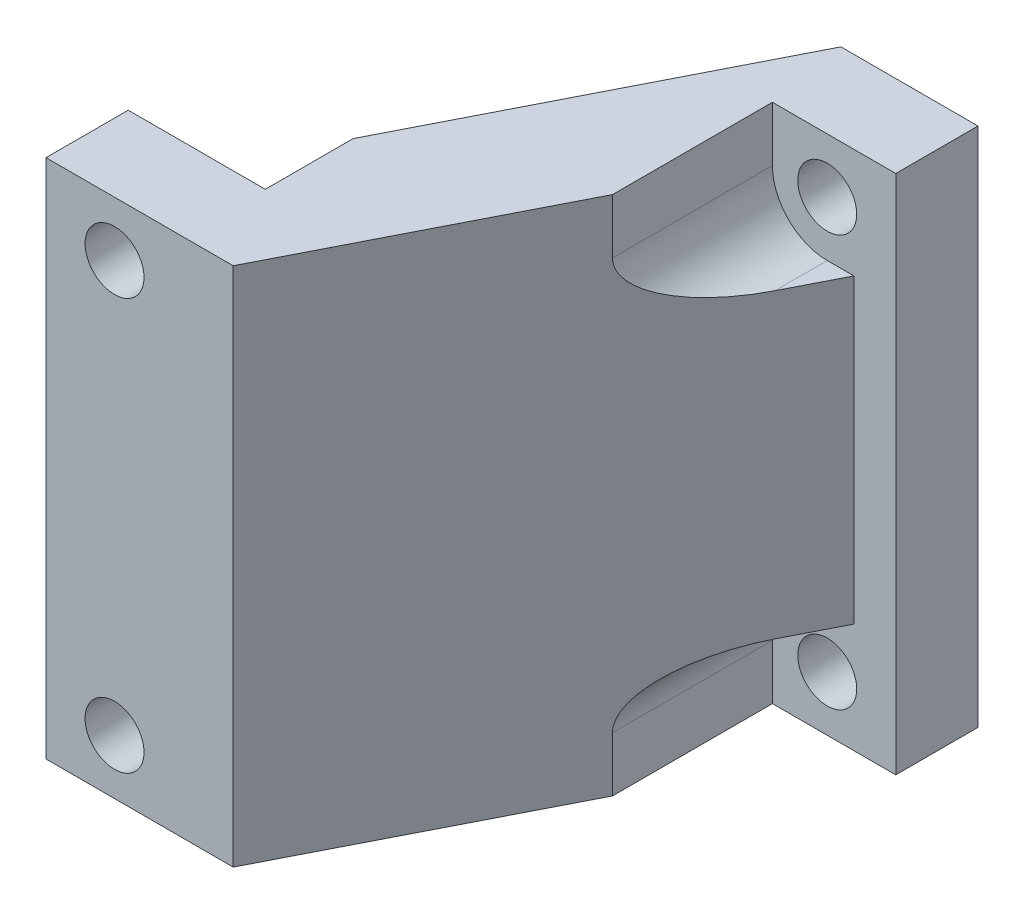
ISO-10303-21;
HEADER;
FILE_DESCRIPTION(('STEP AP214'),'2;1');
FILE_NAME('part.step','',(''),(''),'','','');
FILE_SCHEMA(('AUTOMOTIVE_DESIGN { 1 0 10303 214 1 1 1 1 }'));
ENDSEC;
DATA;
#1=APPLICATION_CONTEXT('core data for automotive mechanical design processes');
#2=APPLICATION_PROTOCOL_DEFINITION('international standard','automotive_design',2000,#1);
#3=PRODUCT_CONTEXT('',#1,'mechanical');
#4=PRODUCT('Part','Part','',(#3));
#5=PRODUCT_RELATED_PRODUCT_CATEGORY('part','',(#4));
#6=PRODUCT_DEFINITION_FORMATION('','',#4);
#7=PRODUCT_DEFINITION_CONTEXT('part definition',#1,'design');
#8=PRODUCT_DEFINITION('design','',#6,#7);
#9=PRODUCT_DEFINITION_SHAPE('','',#8);
#10=(LENGTH_UNIT() NAMED_UNIT(*) SI_UNIT(.MILLI.,.METRE.));
#11=(NAMED_UNIT(*) PLANE_ANGLE_UNIT() SI_UNIT($,.RADIAN.));
#12=(NAMED_UNIT(*) SI_UNIT($,.STERADIAN.) SOLID_ANGLE_UNIT());
#13=UNCERTAINTY_MEASURE_WITH_UNIT(LENGTH_MEASURE(1.E-05),#10,'distance_accuracy_value','');
#14=(GEOMETRIC_REPRESENTATION_CONTEXT(3) GLOBAL_UNCERTAINTY_ASSIGNED_CONTEXT((#13)) GLOBAL_UNIT_ASSIGNED_CONTEXT((#10,
#11,#12)) REPRESENTATION_CONTEXT('',''));
#15=CARTESIAN_POINT('',(0.,0.,0.));
#16=DIRECTION('',(0.,0.,1.));
#17=DIRECTION('',(1.,0.,0.));
#18=AXIS2_PLACEMENT_3D('',#15,#16,#17);
#19=CARTESIAN_POINT('',(134.360280761,-68.005114056,-48.2));
#20=DIRECTION('',(-0.891354901098317,0.,-0.45330612205));
#21=DIRECTION('',(-0.45330612205,0.,0.891354901098317));
#22=AXIS2_PLACEMENT_3D('',#19,#20,#21);
#23=PLANE('',#22);
#24=DIRECTION('',(-0.45330612205,0.,0.891354901098317));
#25=VECTOR('',#24,1.);
#26=CARTESIAN_POINT('',(141.988658439,-68.005114056,-63.2));
#27=LINE('',#26,#25);
#28=CARTESIAN_POINT('',(141.988658439,-68.005114056,-63.2));
#29=VERTEX_POINT('',#28);
#30=CARTESIAN_POINT('',(129.988658439,-68.005114056,-39.603895088));
#31=VERTEX_POINT('',#30);
#32=EDGE_CURVE('E11',#29,#31,#27,.T.);
#33=ORIENTED_EDGE('',*,*,#32,.T.);
#34=DIRECTION('',(0.,1.,0.));
#35=VECTOR('',#34,1.);
#36=CARTESIAN_POINT('',(129.988658439,-68.005114056,-39.603895088));
#37=LINE('',#36,#35);
#38=CARTESIAN_POINT('',(129.988658439,-64.005114056,-39.603895088));
#39=VERTEX_POINT('',#38);
#40=EDGE_CURVE('E48',#31,#39,#37,.T.);
#41=ORIENTED_EDGE('',*,*,#40,.T.);
#42=CARTESIAN_POINT('',(124.988658439,-64.005114056,-29.772184708));
#43=DIRECTION('',(0.891354901098317,0.,0.45330612205));
#44=DIRECTION('',(0.45330612205,0.,-0.891354901098317));
#45=AXIS2_PLACEMENT_3D('',#42,#43,#44);
#46=ELLIPSE('',#45,11.030073844,5.);
#47=CARTESIAN_POINT('',(126.731903083,-59.318847086,-33.2));
#48=VERTEX_POINT('',#47);
#49=EDGE_CURVE('E225',#39,#48,#46,.T.);
#50=ORIENTED_EDGE('',*,*,#49,.T.);
#51=DIRECTION('',(0.,1.,0.));
#52=VECTOR('',#51,1.);
#53=CARTESIAN_POINT('',(126.731903083,-59.318847086,-33.2));
#54=LINE('',#53,#52);
#55=CARTESIAN_POINT('',(126.731903083,-38.691381026,-33.2));
#56=VERTEX_POINT('',#55);
#57=EDGE_CURVE('E228',#48,#56,#54,.T.);
#58=ORIENTED_EDGE('',*,*,#57,.T.);
#59=CARTESIAN_POINT('',(124.988658439,-34.005114056,-29.772184708));
#60=DIRECTION('',(0.891354901098317,0.,0.45330612205));
#61=DIRECTION('',(0.45330612205,0.,-0.891354901098317));
#62=AXIS2_PLACEMENT_3D('',#59,#60,#61);
#63=ELLIPSE('',#62,11.030073844,5.);
#64=CARTESIAN_POINT('',(129.988658439,-34.005114056,-39.603895088));
#65=VERTEX_POINT('',#64);
#66=EDGE_CURVE('E248',#56,#65,#63,.T.);
#67=ORIENTED_EDGE('',*,*,#66,.T.);
#68=DIRECTION('',(0.,1.,0.));
#69=VECTOR('',#68,1.);
#70=CARTESIAN_POINT('',(129.988658439,-34.005114056,-39.603895088));
#71=LINE('',#70,#69);
#72=CARTESIAN_POINT('',(129.988658439,-30.005114056,-39.603895088));
#73=VERTEX_POINT('',#72);
#74=EDGE_CURVE('E222',#65,#73,#71,.T.);
#75=ORIENTED_EDGE('',*,*,#74,.T.);
#76=DIRECTION('',(-0.45330612205,0.,0.891354901098317));
#77=VECTOR('',#76,1.);
#78=CARTESIAN_POINT('',(141.988658439,-30.005114056,-63.2));
#79=LINE('',#78,#77);
#80=CARTESIAN_POINT('',(141.988658439,-30.005114056,-63.2));
#81=VERTEX_POINT('',#80);
#82=EDGE_CURVE('E182',#81,#73,#79,.T.);
#83=ORIENTED_EDGE('',*,*,#82,.F.);
#84=DIRECTION('',(0.,1.,0.));
#85=VECTOR('',#84,1.);
#86=CARTESIAN_POINT('',(141.988658439,-68.005114056,-63.2));
#87=LINE('',#86,#85);
#88=EDGE_CURVE('E42',#29,#81,#87,.T.);
#89=ORIENTED_EDGE('',*,*,#88,.F.);
#90=EDGE_LOOP('',(#33,#41,#50,#58,#67,#75,#83,#89));
#91=FACE_BOUND('',#90,.T.);
#92=ADVANCED_FACE('F38',(#91),#23,.T.);
#93=CARTESIAN_POINT('',(-140.011341561,-68.005114056,247.8));
#94=DIRECTION('',(0.,-1.,0.));
#95=DIRECTION('',(0.,0.,-1.));
#96=AXIS2_PLACEMENT_3D('',#93,#94,#95);
#97=PLANE('',#96);
#98=DIRECTION('',(1.,0.,0.));
#99=VECTOR('',#98,1.);
#100=CARTESIAN_POINT('',(119.988658439,-68.005114056,-33.2));
#101=LINE('',#100,#99);
#102=CARTESIAN_POINT('',(119.988658439,-68.005114056,-33.2));
#103=VERTEX_POINT('',#102);
#104=CARTESIAN_POINT('',(129.988658439,-68.005114056,-33.2));
#105=VERTEX_POINT('',#104);
#106=EDGE_CURVE('E190',#103,#105,#101,.T.);
#107=ORIENTED_EDGE('',*,*,#106,.T.);
#108=DIRECTION('',(0.,0.,-1.));
#109=VECTOR('',#108,1.);
#110=CARTESIAN_POINT('',(129.988658439,-68.005114056,-33.2));
#111=LINE('',#110,#109);
#112=EDGE_CURVE('E187',#105,#31,#111,.T.);
#113=ORIENTED_EDGE('',*,*,#112,.T.);
#114=ORIENTED_EDGE('',*,*,#32,.F.);
#115=DIRECTION('',(-1.,0.,0.));
#116=VECTOR('',#115,1.);
#117=CARTESIAN_POINT('',(151.988658439,-68.005114056,-63.2));
#118=LINE('',#117,#116);
#119=CARTESIAN_POINT('',(151.988658439,-68.005114056,-63.2));
#120=VERTEX_POINT('',#119);
#121=EDGE_CURVE('E329',#120,#29,#118,.T.);
#122=ORIENTED_EDGE('',*,*,#121,.F.);
#123=DIRECTION('',(0.,0.,1.));
#124=VECTOR('',#123,1.);
#125=CARTESIAN_POINT('',(151.988658439,-68.005114056,-63.2));
#126=LINE('',#125,#124);
#127=CARTESIAN_POINT('',(151.988658439,-68.005114056,-57.2));
#128=VERTEX_POINT('',#127);
#129=EDGE_CURVE('E191',#120,#128,#126,.T.);
#130=ORIENTED_EDGE('',*,*,#129,.T.);
#131=DIRECTION('',(-1.,0.,0.));
#132=VECTOR('',#131,1.);
#133=CARTESIAN_POINT('',(151.988658439,-68.005114056,-57.2));
#134=LINE('',#133,#132);
#135=CARTESIAN_POINT('',(142.988658439,-68.005114056,-57.2));
#136=VERTEX_POINT('',#135);
#137=EDGE_CURVE('E241',#128,#136,#134,.T.);
#138=ORIENTED_EDGE('',*,*,#137,.T.);
#139=DIRECTION('',(0.,0.,-1.));
#140=VECTOR('',#139,1.);
#141=CARTESIAN_POINT('',(142.988658439,-68.005114056,-45.533696838));
#142=LINE('',#141,#140);
#143=CARTESIAN_POINT('',(142.988658439,-68.005114056,-45.533696838));
#144=VERTEX_POINT('',#143);
#145=EDGE_CURVE('E235',#144,#136,#142,.T.);
#146=ORIENTED_EDGE('',*,*,#145,.F.);
#147=DIRECTION('',(0.453933197028941,0.,-0.891035719056809));
#148=VECTOR('',#147,1.);
#149=CARTESIAN_POINT('',(133.648658439,-68.005114056,-27.2));
#150=LINE('',#149,#148);
#151=CARTESIAN_POINT('',(133.648658439,-68.005114056,-27.2));
#152=VERTEX_POINT('',#151);
#153=EDGE_CURVE('E219',#152,#144,#150,.T.);
#154=ORIENTED_EDGE('',*,*,#153,.F.);
#155=DIRECTION('',(1.,0.,0.));
#156=VECTOR('',#155,1.);
#157=CARTESIAN_POINT('',(119.988658439,-68.005114056,-27.2));
#158=LINE('',#157,#156);
#159=CARTESIAN_POINT('',(119.988658439,-68.005114056,-27.2));
#160=VERTEX_POINT('',#159);
#161=EDGE_CURVE('E255',#160,#152,#158,.T.);
#162=ORIENTED_EDGE('',*,*,#161,.F.);
#163=DIRECTION('',(0.,0.,-1.));
#164=VECTOR('',#163,1.);
#165=CARTESIAN_POINT('',(119.988658439,-68.005114056,-27.2));
#166=LINE('',#165,#164);
#167=EDGE_CURVE('E244',#160,#103,#166,.T.);
#168=ORIENTED_EDGE('',*,*,#167,.T.);
#169=EDGE_LOOP('',(#107,#113,#114,#122,#130,#138,#146,#154,#162,#168));
#170=FACE_BOUND('',#169,.T.);
#171=ADVANCED_FACE('F399',(#170),#97,.T.);
#172=CARTESIAN_POINT('',(142.818658439,-68.005114056,-45.2));
#173=DIRECTION('',(0.891035719056809,0.,0.453933197028941));
#174=DIRECTION('',(0.,-1.,0.));
#175=AXIS2_PLACEMENT_3D('',#172,#173,#174);
#176=PLANE('',#175);
#177=CARTESIAN_POINT('',(146.988658439,-64.005114056,-53.385387132));
#178=DIRECTION('',(-0.891035719056809,0.,-0.453933197028941));
#179=DIRECTION('',(0.453933197028941,0.,-0.891035719056809));
#180=AXIS2_PLACEMENT_3D('',#177,#178,#179);
#181=ELLIPSE('',#180,8.811869295,4.);
#182=CARTESIAN_POINT('',(142.988658439,-64.005114056,-45.533696838));
#183=VERTEX_POINT('',#182);
#184=CARTESIAN_POINT('',(146.988658439,-60.005114056,-53.385387132));
#185=VERTEX_POINT('',#184);
#186=EDGE_CURVE('E272',#183,#185,#181,.T.);
#187=ORIENTED_EDGE('',*,*,#186,.T.);
#188=DIRECTION('',(0.453933197028941,0.,-0.891035719056809));
#189=VECTOR('',#188,1.);
#190=CARTESIAN_POINT('',(146.988658439,-60.005114056,-53.385387132));
#191=LINE('',#190,#189);
#192=CARTESIAN_POINT('',(148.931991772,-60.005114056,-57.2));
#193=VERTEX_POINT('',#192);
#194=EDGE_CURVE('E109',#185,#193,#191,.T.);
#195=ORIENTED_EDGE('',*,*,#194,.T.);
#196=DIRECTION('',(0.,1.,0.));
#197=VECTOR('',#196,1.);
#198=CARTESIAN_POINT('',(148.931991772,-60.005114056,-57.2));
#199=LINE('',#198,#197);
#200=CARTESIAN_POINT('',(148.931991772,-38.005114056,-57.2));
#201=VERTEX_POINT('',#200);
#202=EDGE_CURVE('E101',#193,#201,#199,.T.);
#203=ORIENTED_EDGE('',*,*,#202,.T.);
#204=DIRECTION('',(-0.453933197028941,0.,0.891035719056809));
#205=VECTOR('',#204,1.);
#206=CARTESIAN_POINT('',(148.931991772,-38.005114056,-57.2));
#207=LINE('',#206,#205);
#208=CARTESIAN_POINT('',(146.988658439,-38.005114056,-53.385387132));
#209=VERTEX_POINT('',#208);
#210=EDGE_CURVE('E310',#201,#209,#207,.T.);
#211=ORIENTED_EDGE('',*,*,#210,.T.);
#212=CARTESIAN_POINT('',(146.988658439,-34.005114056,-53.385387132));
#213=DIRECTION('',(-0.891035719056809,0.,-0.453933197028941));
#214=DIRECTION('',(0.453933197028941,0.,-0.891035719056809));
#215=AXIS2_PLACEMENT_3D('',#212,#213,#214);
#216=ELLIPSE('',#215,8.811869295,4.);
#217=CARTESIAN_POINT('',(142.988658439,-34.005114056,-45.533696838));
#218=VERTEX_POINT('',#217);
#219=EDGE_CURVE('E218',#209,#218,#216,.T.);
#220=ORIENTED_EDGE('',*,*,#219,.T.);
#221=DIRECTION('',(0.,1.,0.));
#222=VECTOR('',#221,1.);
#223=CARTESIAN_POINT('',(142.988658439,-34.005114056,-45.533696838));
#224=LINE('',#223,#222);
#225=CARTESIAN_POINT('',(142.988658439,-30.005114056,-45.533696838));
#226=VERTEX_POINT('',#225);
#227=EDGE_CURVE('E215',#218,#226,#224,.T.);
#228=ORIENTED_EDGE('',*,*,#227,.T.);
#229=DIRECTION('',(0.453933197028941,0.,-0.891035719056809));
#230=VECTOR('',#229,1.);
#231=CARTESIAN_POINT('',(133.648658439,-30.005114056,-27.2));
#232=LINE('',#231,#230);
#233=CARTESIAN_POINT('',(133.648658439,-30.005114056,-27.2));
#234=VERTEX_POINT('',#233);
#235=EDGE_CURVE('E183',#234,#226,#232,.T.);
#236=ORIENTED_EDGE('',*,*,#235,.F.);
#237=DIRECTION('',(0.,1.,0.));
#238=VECTOR('',#237,1.);
#239=CARTESIAN_POINT('',(133.648658439,-68.005114056,-27.2));
#240=LINE('',#239,#238);
#241=EDGE_CURVE('E239',#152,#234,#240,.T.);
#242=ORIENTED_EDGE('',*,*,#241,.F.);
#243=ORIENTED_EDGE('',*,*,#153,.T.);
#244=DIRECTION('',(0.,1.,0.));
#245=VECTOR('',#244,1.);
#246=CARTESIAN_POINT('',(142.988658439,-68.005114056,-45.533696838));
#247=LINE('',#246,#245);
#248=EDGE_CURVE('E196',#144,#183,#247,.T.);
#249=ORIENTED_EDGE('',*,*,#248,.T.);
#250=EDGE_LOOP('',(#187,#195,#203,#211,#220,#228,#236,#242,#243,#249));
#251=FACE_BOUND('',#250,.T.);
#252=ADVANCED_FACE('F383',(#251),#176,.T.);
#253=CARTESIAN_POINT('',(-140.011341561,-30.005114056,247.8));
#254=DIRECTION('',(0.,-1.,0.));
#255=DIRECTION('',(0.,0.,-1.));
#256=AXIS2_PLACEMENT_3D('',#253,#254,#255);
#257=PLANE('',#256);
#258=DIRECTION('',(0.,0.,-1.));
#259=VECTOR('',#258,1.);
#260=CARTESIAN_POINT('',(129.988658439,-30.005114056,-33.2));
#261=LINE('',#260,#259);
#262=CARTESIAN_POINT('',(129.988658439,-30.005114056,-33.2));
#263=VERTEX_POINT('',#262);
#264=EDGE_CURVE('E261',#263,#73,#261,.T.);
#265=ORIENTED_EDGE('',*,*,#264,.F.);
#266=DIRECTION('',(1.,0.,0.));
#267=VECTOR('',#266,1.);
#268=CARTESIAN_POINT('',(119.988658439,-30.005114056,-33.2));
#269=LINE('',#268,#267);
#270=CARTESIAN_POINT('',(119.988658439,-30.005114056,-33.2));
#271=VERTEX_POINT('',#270);
#272=EDGE_CURVE('E161',#271,#263,#269,.T.);
#273=ORIENTED_EDGE('',*,*,#272,.F.);
#274=DIRECTION('',(0.,0.,-1.));
#275=VECTOR('',#274,1.);
#276=CARTESIAN_POINT('',(119.988658439,-30.005114056,-27.2));
#277=LINE('',#276,#275);
#278=CARTESIAN_POINT('',(119.988658439,-30.005114056,-27.2));
#279=VERTEX_POINT('',#278);
#280=EDGE_CURVE('E224',#279,#271,#277,.T.);
#281=ORIENTED_EDGE('',*,*,#280,.F.);
#282=DIRECTION('',(1.,0.,0.));
#283=VECTOR('',#282,1.);
#284=CARTESIAN_POINT('',(119.988658439,-30.005114056,-27.2));
#285=LINE('',#284,#283);
#286=EDGE_CURVE('E185',#279,#234,#285,.T.);
#287=ORIENTED_EDGE('',*,*,#286,.T.);
#288=ORIENTED_EDGE('',*,*,#235,.T.);
#289=DIRECTION('',(0.,0.,-1.));
#290=VECTOR('',#289,1.);
#291=CARTESIAN_POINT('',(142.988658439,-30.005114056,-45.533696838));
#292=LINE('',#291,#290);
#293=CARTESIAN_POINT('',(142.988658439,-30.005114056,-57.2));
#294=VERTEX_POINT('',#293);
#295=EDGE_CURVE('E186',#226,#294,#292,.T.);
#296=ORIENTED_EDGE('',*,*,#295,.T.);
#297=DIRECTION('',(-1.,0.,0.));
#298=VECTOR('',#297,1.);
#299=CARTESIAN_POINT('',(151.988658439,-30.005114056,-57.2));
#300=LINE('',#299,#298);
#301=CARTESIAN_POINT('',(151.988658439,-30.005114056,-57.2));
#302=VERTEX_POINT('',#301);
#303=EDGE_CURVE('E251',#302,#294,#300,.T.);
#304=ORIENTED_EDGE('',*,*,#303,.F.);
#305=DIRECTION('',(0.,0.,1.));
#306=VECTOR('',#305,1.);
#307=CARTESIAN_POINT('',(151.988658439,-30.005114056,-63.2));
#308=LINE('',#307,#306);
#309=CARTESIAN_POINT('',(151.988658439,-30.005114056,-63.2));
#310=VERTEX_POINT('',#309);
#311=EDGE_CURVE('E295',#310,#302,#308,.T.);
#312=ORIENTED_EDGE('',*,*,#311,.F.);
#313=DIRECTION('',(-1.,0.,0.));
#314=VECTOR('',#313,1.);
#315=CARTESIAN_POINT('',(151.988658439,-30.005114056,-63.2));
#316=LINE('',#315,#314);
#317=EDGE_CURVE('E287',#310,#81,#316,.T.);
#318=ORIENTED_EDGE('',*,*,#317,.T.);
#319=ORIENTED_EDGE('',*,*,#82,.T.);
#320=EDGE_LOOP('',(#265,#273,#281,#287,#288,#296,#304,#312,#318,#319));
#321=FACE_BOUND('',#320,.T.);
#322=ADVANCED_FACE('F387',(#321),#257,.F.);
#323=CARTESIAN_POINT('',(146.988658439,-34.005114056,-34.2));
#324=DIRECTION('',(0.,0.,-1.));
#325=DIRECTION('',(0.,1.,0.));
#326=AXIS2_PLACEMENT_3D('',#323,#324,#325);
#327=CYLINDRICAL_SURFACE('',#326,2.15);
#328=DIRECTION('',(0.,0.,1.));
#329=VECTOR('',#328,1.);
#330=CARTESIAN_POINT('',(146.988658439,-31.855114056,-63.2));
#331=LINE('',#330,#329);
#332=CARTESIAN_POINT('',(146.988658439,-31.855114056,-63.2));
#333=VERTEX_POINT('',#332);
#334=CARTESIAN_POINT('',(146.988658439,-31.855114056,-57.2));
#335=VERTEX_POINT('',#334);
#336=EDGE_CURVE('E179',#333,#335,#331,.T.);
#337=ORIENTED_EDGE('',*,*,#336,.F.);
#338=CARTESIAN_POINT('',(146.988658439,-34.005114056,-63.2));
#339=DIRECTION('',(0.,0.,1.));
#340=DIRECTION('',(0.,-1.,0.));
#341=AXIS2_PLACEMENT_3D('',#338,#339,#340);
#342=CIRCLE('',#341,2.15);
#343=CARTESIAN_POINT('',(146.988658439,-36.155114056,-63.2));
#344=VERTEX_POINT('',#343);
#345=EDGE_CURVE('E171',#344,#333,#342,.T.);
#346=ORIENTED_EDGE('',*,*,#345,.F.);
#347=CARTESIAN_POINT('',(146.988658439,-34.005114056,-63.2));
#348=DIRECTION('',(0.,0.,1.));
#349=DIRECTION('',(0.,-1.,0.));
#350=AXIS2_PLACEMENT_3D('',#347,#348,#349);
#351=CIRCLE('',#350,2.15);
#352=EDGE_CURVE('E174',#333,#344,#351,.T.);
#353=ORIENTED_EDGE('',*,*,#352,.F.);
#354=ORIENTED_EDGE('',*,*,#336,.T.);
#355=CARTESIAN_POINT('',(146.988658439,-34.005114056,-57.2));
#356=DIRECTION('',(0.,0.,1.));
#357=DIRECTION('',(0.,1.,0.));
#358=AXIS2_PLACEMENT_3D('',#355,#356,#357);
#359=CIRCLE('',#358,2.15);
#360=EDGE_CURVE('E169',#335,#335,#359,.T.);
#361=ORIENTED_EDGE('',*,*,#360,.T.);
#362=EDGE_LOOP('',(#337,#346,#353,#354,#361));
#363=FACE_BOUND('',#362,.T.);
#364=ADVANCED_FACE('F447',(#363),#327,.F.);
#365=CARTESIAN_POINT('',(146.988658439,-64.005114056,-34.2));
#366=DIRECTION('',(0.,0.,-1.));
#367=DIRECTION('',(0.,1.,0.));
#368=AXIS2_PLACEMENT_3D('',#365,#366,#367);
#369=CYLINDRICAL_SURFACE('',#368,2.15);
#370=DIRECTION('',(0.,0.,1.));
#371=VECTOR('',#370,1.);
#372=CARTESIAN_POINT('',(146.988658439,-61.855114056,-63.2));
#373=LINE('',#372,#371);
#374=CARTESIAN_POINT('',(146.988658439,-61.855114056,-63.2));
#375=VERTEX_POINT('',#374);
#376=CARTESIAN_POINT('',(146.988658439,-61.855114056,-57.2));
#377=VERTEX_POINT('',#376);
#378=EDGE_CURVE('E165',#375,#377,#373,.T.);
#379=ORIENTED_EDGE('',*,*,#378,.F.);
#380=CARTESIAN_POINT('',(146.988658439,-64.005114056,-63.2));
#381=DIRECTION('',(0.,0.,1.));
#382=DIRECTION('',(0.,-1.,0.));
#383=AXIS2_PLACEMENT_3D('',#380,#381,#382);
#384=CIRCLE('',#383,2.15);
#385=CARTESIAN_POINT('',(146.988658439,-66.155114056,-63.2));
#386=VERTEX_POINT('',#385);
#387=EDGE_CURVE('E154',#386,#375,#384,.T.);
#388=ORIENTED_EDGE('',*,*,#387,.F.);
#389=CARTESIAN_POINT('',(146.988658439,-64.005114056,-63.2));
#390=DIRECTION('',(0.,0.,1.));
#391=DIRECTION('',(0.,-1.,0.));
#392=AXIS2_PLACEMENT_3D('',#389,#390,#391);
#393=CIRCLE('',#392,2.15);
#394=EDGE_CURVE('E159',#375,#386,#393,.T.);
#395=ORIENTED_EDGE('',*,*,#394,.F.);
#396=ORIENTED_EDGE('',*,*,#378,.T.);
#397=CARTESIAN_POINT('',(146.988658439,-64.005114056,-57.2));
#398=DIRECTION('',(0.,0.,1.));
#399=DIRECTION('',(0.,1.,0.));
#400=AXIS2_PLACEMENT_3D('',#397,#398,#399);
#401=CIRCLE('',#400,2.15);
#402=EDGE_CURVE('E168',#377,#377,#401,.T.);
#403=ORIENTED_EDGE('',*,*,#402,.T.);
#404=EDGE_LOOP('',(#379,#388,#395,#396,#403));
#405=FACE_BOUND('',#404,.T.);
#406=ADVANCED_FACE('F166',(#405),#369,.F.);
#407=CARTESIAN_POINT('',(119.988658439,-68.005114056,-30.2));
#408=DIRECTION('',(1.,0.,0.));
#409=DIRECTION('',(0.,1.,0.));
#410=AXIS2_PLACEMENT_3D('',#407,#408,#409);
#411=PLANE('',#410);
#412=ORIENTED_EDGE('',*,*,#280,.T.);
#413=DIRECTION('',(0.,1.,0.));
#414=VECTOR('',#413,1.);
#415=CARTESIAN_POINT('',(119.988658439,-68.005114056,-33.2));
#416=LINE('',#415,#414);
#417=EDGE_CURVE('E229',#103,#271,#416,.T.);
#418=ORIENTED_EDGE('',*,*,#417,.F.);
#419=ORIENTED_EDGE('',*,*,#167,.F.);
#420=DIRECTION('',(0.,1.,0.));
#421=VECTOR('',#420,1.);
#422=CARTESIAN_POINT('',(119.988658439,-68.005114056,-27.2));
#423=LINE('',#422,#421);
#424=EDGE_CURVE('E232',#160,#279,#423,.T.);
#425=ORIENTED_EDGE('',*,*,#424,.T.);
#426=EDGE_LOOP('',(#412,#418,#419,#425));
#427=FACE_BOUND('',#426,.T.);
#428=ADVANCED_FACE('F391',(#427),#411,.F.);
#429=CARTESIAN_POINT('',(123.360280761,-68.005114056,-33.2));
#430=DIRECTION('',(0.,0.,1.));
#431=DIRECTION('',(1.,0.,0.));
#432=AXIS2_PLACEMENT_3D('',#429,#430,#431);
#433=PLANE('',#432);
#434=CARTESIAN_POINT('',(124.988658439,-34.005114056,-33.2));
#435=DIRECTION('',(0.,0.,-1.));
#436=DIRECTION('',(0.,-1.,0.));
#437=AXIS2_PLACEMENT_3D('',#434,#435,#436);
#438=CIRCLE('',#437,2.15);
#439=CARTESIAN_POINT('',(124.988658439,-31.855114056,-33.2));
#440=VERTEX_POINT('',#439);
#441=CARTESIAN_POINT('',(124.988658439,-36.155114056,-33.2));
#442=VERTEX_POINT('',#441);
#443=EDGE_CURVE('E282',#440,#442,#438,.T.);
#444=ORIENTED_EDGE('',*,*,#443,.F.);
#445=CARTESIAN_POINT('',(124.988658439,-34.005114056,-33.2));
#446=DIRECTION('',(0.,0.,-1.));
#447=DIRECTION('',(0.,-1.,0.));
#448=AXIS2_PLACEMENT_3D('',#445,#446,#447);
#449=CIRCLE('',#448,2.15);
#450=EDGE_CURVE('E269',#442,#440,#449,.T.);
#451=ORIENTED_EDGE('',*,*,#450,.F.);
#452=EDGE_LOOP('',(#444,#451));
#453=FACE_BOUND('',#452,.T.);
#454=ORIENTED_EDGE('',*,*,#57,.F.);
#455=CARTESIAN_POINT('',(124.988658439,-64.005114056,-33.2));
#456=DIRECTION('',(0.,0.,1.));
#457=DIRECTION('',(0.,1.,0.));
#458=AXIS2_PLACEMENT_3D('',#455,#456,#457);
#459=CIRCLE('',#458,5.);
#460=CARTESIAN_POINT('',(129.988658439,-64.005114056,-33.2));
#461=VERTEX_POINT('',#460);
#462=EDGE_CURVE('E275',#461,#48,#459,.T.);
#463=ORIENTED_EDGE('',*,*,#462,.F.);
#464=DIRECTION('',(0.,1.,0.));
#465=VECTOR('',#464,1.);
#466=CARTESIAN_POINT('',(129.988658439,-68.005114056,-33.2));
#467=LINE('',#466,#465);
#468=EDGE_CURVE('E265',#105,#461,#467,.T.);
#469=ORIENTED_EDGE('',*,*,#468,.F.);
#470=ORIENTED_EDGE('',*,*,#106,.F.);
#471=ORIENTED_EDGE('',*,*,#417,.T.);
#472=ORIENTED_EDGE('',*,*,#272,.T.);
#473=DIRECTION('',(0.,1.,0.));
#474=VECTOR('',#473,1.);
#475=CARTESIAN_POINT('',(129.988658439,-34.005114056,-33.2));
#476=LINE('',#475,#474);
#477=CARTESIAN_POINT('',(129.988658439,-34.005114056,-33.2));
#478=VERTEX_POINT('',#477);
#479=EDGE_CURVE('E264',#478,#263,#476,.T.);
#480=ORIENTED_EDGE('',*,*,#479,.F.);
#481=CARTESIAN_POINT('',(124.988658439,-34.005114056,-33.2));
#482=DIRECTION('',(0.,0.,1.));
#483=DIRECTION('',(0.,1.,0.));
#484=AXIS2_PLACEMENT_3D('',#481,#482,#483);
#485=CIRCLE('',#484,5.);
#486=EDGE_CURVE('E197',#56,#478,#485,.T.);
#487=ORIENTED_EDGE('',*,*,#486,.F.);
#488=EDGE_LOOP('',(#454,#463,#469,#470,#471,#472,#480,#487));
#489=FACE_BOUND('',#488,.T.);
#490=CARTESIAN_POINT('',(124.988658439,-64.005114056,-33.2));
#491=DIRECTION('',(0.,0.,-1.));
#492=DIRECTION('',(0.,-1.,0.));
#493=AXIS2_PLACEMENT_3D('',#490,#491,#492);
#494=CIRCLE('',#493,2.15);
#495=CARTESIAN_POINT('',(124.988658439,-61.855114056,-33.2));
#496=VERTEX_POINT('',#495);
#497=CARTESIAN_POINT('',(124.988658439,-66.155114056,-33.2));
#498=VERTEX_POINT('',#497);
#499=EDGE_CURVE('E236',#496,#498,#494,.T.);
#500=ORIENTED_EDGE('',*,*,#499,.F.);
#501=CARTESIAN_POINT('',(124.988658439,-64.005114056,-33.2));
#502=DIRECTION('',(0.,0.,-1.));
#503=DIRECTION('',(0.,-1.,0.));
#504=AXIS2_PLACEMENT_3D('',#501,#502,#503);
#505=CIRCLE('',#504,2.15);
#506=EDGE_CURVE('E240',#498,#496,#505,.T.);
#507=ORIENTED_EDGE('',*,*,#506,.F.);
#508=EDGE_LOOP('',(#500,#507));
#509=FACE_BOUND('',#508,.T.);
#510=ADVANCED_FACE('F40',(#453,#489,#509),#433,.F.);
#511=CARTESIAN_POINT('',(144.488658439,-68.005114056,-63.2));
#512=DIRECTION('',(0.,0.,-1.));
#513=DIRECTION('',(0.,-1.,0.));
#514=AXIS2_PLACEMENT_3D('',#511,#512,#513);
#515=PLANE('',#514);
#516=ORIENTED_EDGE('',*,*,#387,.T.);
#517=ORIENTED_EDGE('',*,*,#394,.T.);
#518=EDGE_LOOP('',(#516,#517));
#519=FACE_BOUND('',#518,.T.);
#520=ORIENTED_EDGE('',*,*,#345,.T.);
#521=ORIENTED_EDGE('',*,*,#352,.T.);
#522=EDGE_LOOP('',(#520,#521));
#523=FACE_BOUND('',#522,.T.);
#524=ORIENTED_EDGE('',*,*,#317,.F.);
#525=DIRECTION('',(0.,1.,0.));
#526=VECTOR('',#525,1.);
#527=CARTESIAN_POINT('',(151.988658439,-68.005114056,-63.2));
#528=LINE('',#527,#526);
#529=EDGE_CURVE('E292',#120,#310,#528,.T.);
#530=ORIENTED_EDGE('',*,*,#529,.F.);
#531=ORIENTED_EDGE('',*,*,#121,.T.);
#532=ORIENTED_EDGE('',*,*,#88,.T.);
#533=EDGE_LOOP('',(#524,#530,#531,#532));
#534=FACE_BOUND('',#533,.T.);
#535=ADVANCED_FACE('F156',(#519,#523,#534),#515,.T.);
#536=CARTESIAN_POINT('',(151.988658439,-68.005114056,-60.2));
#537=DIRECTION('',(-1.,0.,0.));
#538=DIRECTION('',(0.,0.,1.));
#539=AXIS2_PLACEMENT_3D('',#536,#537,#538);
#540=PLANE('',#539);
#541=ORIENTED_EDGE('',*,*,#311,.T.);
#542=DIRECTION('',(0.,1.,0.));
#543=VECTOR('',#542,1.);
#544=CARTESIAN_POINT('',(151.988658439,-68.005114056,-57.2));
#545=LINE('',#544,#543);
#546=EDGE_CURVE('E214',#128,#302,#545,.T.);
#547=ORIENTED_EDGE('',*,*,#546,.F.);
#548=ORIENTED_EDGE('',*,*,#129,.F.);
#549=ORIENTED_EDGE('',*,*,#529,.T.);
#550=EDGE_LOOP('',(#541,#547,#548,#549));
#551=FACE_BOUND('',#550,.T.);
#552=ADVANCED_FACE('F493',(#551),#540,.F.);
#553=CARTESIAN_POINT('',(150.460325105,-68.005114056,-57.2));
#554=DIRECTION('',(0.,0.,-1.));
#555=DIRECTION('',(0.,-1.,0.));
#556=AXIS2_PLACEMENT_3D('',#553,#554,#555);
#557=PLANE('',#556);
#558=ORIENTED_EDGE('',*,*,#360,.F.);
#559=EDGE_LOOP('',(#558));
#560=FACE_BOUND('',#559,.T.);
#561=ORIENTED_EDGE('',*,*,#202,.F.);
#562=DIRECTION('',(-1.,0.,0.));
#563=VECTOR('',#562,1.);
#564=CARTESIAN_POINT('',(148.931991772,-60.005114056,-57.2));
#565=LINE('',#564,#563);
#566=CARTESIAN_POINT('',(146.988658439,-60.005114056,-57.2));
#567=VERTEX_POINT('',#566);
#568=EDGE_CURVE('E296',#193,#567,#565,.T.);
#569=ORIENTED_EDGE('',*,*,#568,.T.);
#570=CARTESIAN_POINT('',(146.988658439,-64.005114056,-57.2));
#571=DIRECTION('',(0.,0.,1.));
#572=DIRECTION('',(0.,-1.,0.));
#573=AXIS2_PLACEMENT_3D('',#570,#571,#572);
#574=CIRCLE('',#573,4.);
#575=CARTESIAN_POINT('',(142.988658439,-64.005114056,-57.2));
#576=VERTEX_POINT('',#575);
#577=EDGE_CURVE('E213',#567,#576,#574,.T.);
#578=ORIENTED_EDGE('',*,*,#577,.T.);
#579=DIRECTION('',(0.,-1.,0.));
#580=VECTOR('',#579,1.);
#581=CARTESIAN_POINT('',(142.988658439,-64.005114056,-57.2));
#582=LINE('',#581,#580);
#583=EDGE_CURVE('E210',#576,#136,#582,.T.);
#584=ORIENTED_EDGE('',*,*,#583,.T.);
#585=ORIENTED_EDGE('',*,*,#137,.F.);
#586=ORIENTED_EDGE('',*,*,#546,.T.);
#587=ORIENTED_EDGE('',*,*,#303,.T.);
#588=DIRECTION('',(0.,-1.,0.));
#589=VECTOR('',#588,1.);
#590=CARTESIAN_POINT('',(142.988658439,-30.005114056,-57.2));
#591=LINE('',#590,#589);
#592=CARTESIAN_POINT('',(142.988658439,-34.005114056,-57.2));
#593=VERTEX_POINT('',#592);
#594=EDGE_CURVE('E254',#294,#593,#591,.T.);
#595=ORIENTED_EDGE('',*,*,#594,.T.);
#596=CARTESIAN_POINT('',(146.988658439,-34.005114056,-57.2));
#597=DIRECTION('',(0.,0.,1.));
#598=DIRECTION('',(1.,0.,0.));
#599=AXIS2_PLACEMENT_3D('',#596,#597,#598);
#600=CIRCLE('',#599,4.);
#601=CARTESIAN_POINT('',(146.988658439,-38.005114056,-57.2));
#602=VERTEX_POINT('',#601);
#603=EDGE_CURVE('E247',#593,#602,#600,.T.);
#604=ORIENTED_EDGE('',*,*,#603,.T.);
#605=DIRECTION('',(1.,0.,0.));
#606=VECTOR('',#605,1.);
#607=CARTESIAN_POINT('',(146.988658439,-38.005114056,-57.2));
#608=LINE('',#607,#606);
#609=EDGE_CURVE('E245',#602,#201,#608,.T.);
#610=ORIENTED_EDGE('',*,*,#609,.T.);
#611=EDGE_LOOP('',(#561,#569,#578,#584,#585,#586,#587,#595,#604,#610));
#612=FACE_BOUND('',#611,.T.);
#613=ORIENTED_EDGE('',*,*,#402,.F.);
#614=EDGE_LOOP('',(#613));
#615=FACE_BOUND('',#614,.T.);
#616=ADVANCED_FACE('F458',(#560,#612,#615),#557,.F.);
#617=CARTESIAN_POINT('',(129.318658439,-68.005114056,-27.2));
#618=DIRECTION('',(0.,0.,1.));
#619=DIRECTION('',(1.,0.,0.));
#620=AXIS2_PLACEMENT_3D('',#617,#618,#619);
#621=PLANE('',#620);
#622=CARTESIAN_POINT('',(124.988658439,-34.005114056,-27.2));
#623=DIRECTION('',(0.,0.,-1.));
#624=DIRECTION('',(0.,-1.,0.));
#625=AXIS2_PLACEMENT_3D('',#622,#623,#624);
#626=CIRCLE('',#625,2.15);
#627=CARTESIAN_POINT('',(124.988658439,-36.155114056,-27.2));
#628=VERTEX_POINT('',#627);
#629=CARTESIAN_POINT('',(124.988658439,-31.855114056,-27.2));
#630=VERTEX_POINT('',#629);
#631=EDGE_CURVE('E205',#628,#630,#626,.T.);
#632=ORIENTED_EDGE('',*,*,#631,.T.);
#633=CARTESIAN_POINT('',(124.988658439,-34.005114056,-27.2));
#634=DIRECTION('',(0.,0.,-1.));
#635=DIRECTION('',(0.,-1.,0.));
#636=AXIS2_PLACEMENT_3D('',#633,#634,#635);
#637=CIRCLE('',#636,2.15);
#638=EDGE_CURVE('E202',#630,#628,#637,.T.);
#639=ORIENTED_EDGE('',*,*,#638,.T.);
#640=EDGE_LOOP('',(#632,#639));
#641=FACE_BOUND('',#640,.T.);
#642=CARTESIAN_POINT('',(124.988658439,-64.005114056,-27.2));
#643=DIRECTION('',(0.,0.,-1.));
#644=DIRECTION('',(0.,-1.,0.));
#645=AXIS2_PLACEMENT_3D('',#642,#643,#644);
#646=CIRCLE('',#645,2.15);
#647=CARTESIAN_POINT('',(124.988658439,-66.155114056,-27.2));
#648=VERTEX_POINT('',#647);
#649=CARTESIAN_POINT('',(124.988658439,-61.855114056,-27.2));
#650=VERTEX_POINT('',#649);
#651=EDGE_CURVE('E206',#648,#650,#646,.T.);
#652=ORIENTED_EDGE('',*,*,#651,.T.);
#653=CARTESIAN_POINT('',(124.988658439,-64.005114056,-27.2));
#654=DIRECTION('',(0.,0.,-1.));
#655=DIRECTION('',(0.,-1.,0.));
#656=AXIS2_PLACEMENT_3D('',#653,#654,#655);
#657=CIRCLE('',#656,2.15);
#658=EDGE_CURVE('E258',#650,#648,#657,.T.);
#659=ORIENTED_EDGE('',*,*,#658,.T.);
#660=EDGE_LOOP('',(#652,#659));
#661=FACE_BOUND('',#660,.T.);
#662=ORIENTED_EDGE('',*,*,#286,.F.);
#663=ORIENTED_EDGE('',*,*,#424,.F.);
#664=ORIENTED_EDGE('',*,*,#161,.T.);
#665=ORIENTED_EDGE('',*,*,#241,.T.);
#666=EDGE_LOOP('',(#662,#663,#664,#665));
#667=FACE_BOUND('',#666,.T.);
#668=ADVANCED_FACE('F342',(#641,#661,#667),#621,.T.);
#669=CARTESIAN_POINT('',(124.988658439,-64.005114056,-13.2));
#670=DIRECTION('',(0.,0.,-1.));
#671=DIRECTION('',(0.,1.,0.));
#672=AXIS2_PLACEMENT_3D('',#669,#670,#671);
#673=CYLINDRICAL_SURFACE('',#672,2.15);
#674=DIRECTION('',(0.,0.,1.));
#675=VECTOR('',#674,1.);
#676=CARTESIAN_POINT('',(124.988658439,-61.855114056,-33.2));
#677=LINE('',#676,#675);
#678=EDGE_CURVE('E279',#496,#650,#677,.T.);
#679=ORIENTED_EDGE('',*,*,#678,.F.);
#680=ORIENTED_EDGE('',*,*,#499,.T.);
#681=ORIENTED_EDGE('',*,*,#506,.T.);
#682=ORIENTED_EDGE('',*,*,#678,.T.);
#683=ORIENTED_EDGE('',*,*,#651,.F.);
#684=ORIENTED_EDGE('',*,*,#658,.F.);
#685=EDGE_LOOP('',(#679,#680,#681,#682,#683,#684));
#686=FACE_BOUND('',#685,.T.);
#687=ADVANCED_FACE('F347',(#686),#673,.F.);
#688=CARTESIAN_POINT('',(124.988658439,-34.005114056,-13.2));
#689=DIRECTION('',(0.,0.,-1.));
#690=DIRECTION('',(0.,1.,0.));
#691=AXIS2_PLACEMENT_3D('',#688,#689,#690);
#692=CYLINDRICAL_SURFACE('',#691,2.15);
#693=DIRECTION('',(0.,0.,1.));
#694=VECTOR('',#693,1.);
#695=CARTESIAN_POINT('',(124.988658439,-31.855114056,-33.2));
#696=LINE('',#695,#694);
#697=EDGE_CURVE('E266',#440,#630,#696,.T.);
#698=ORIENTED_EDGE('',*,*,#697,.F.);
#699=ORIENTED_EDGE('',*,*,#443,.T.);
#700=ORIENTED_EDGE('',*,*,#450,.T.);
#701=ORIENTED_EDGE('',*,*,#697,.T.);
#702=ORIENTED_EDGE('',*,*,#631,.F.);
#703=ORIENTED_EDGE('',*,*,#638,.F.);
#704=EDGE_LOOP('',(#698,#699,#700,#701,#702,#703));
#705=FACE_BOUND('',#704,.T.);
#706=ADVANCED_FACE('F504',(#705),#692,.F.);
#707=CARTESIAN_POINT('',(146.988658439,-60.005114056,-24.2));
#708=DIRECTION('',(0.,-1.,0.));
#709=DIRECTION('',(0.,0.,-1.));
#710=AXIS2_PLACEMENT_3D('',#707,#708,#709);
#711=PLANE('',#710);
#712=DIRECTION('',(0.,0.,-1.));
#713=VECTOR('',#712,1.);
#714=CARTESIAN_POINT('',(146.988658439,-60.005114056,-53.385387132));
#715=LINE('',#714,#713);
#716=EDGE_CURVE('E270',#185,#567,#715,.T.);
#717=ORIENTED_EDGE('',*,*,#716,.T.);
#718=ORIENTED_EDGE('',*,*,#568,.F.);
#719=ORIENTED_EDGE('',*,*,#194,.F.);
#720=EDGE_LOOP('',(#717,#718,#719));
#721=FACE_BOUND('',#720,.T.);
#722=ADVANCED_FACE('F502',(#721),#711,.T.);
#723=CARTESIAN_POINT('',(146.988658439,-64.005114056,-24.2));
#724=DIRECTION('',(0.,0.,-1.));
#725=DIRECTION('',(0.,1.,0.));
#726=AXIS2_PLACEMENT_3D('',#723,#724,#725);
#727=CYLINDRICAL_SURFACE('',#726,4.);
#728=DIRECTION('',(0.,0.,-1.));
#729=VECTOR('',#728,1.);
#730=CARTESIAN_POINT('',(142.988658439,-64.005114056,-45.533696838));
#731=LINE('',#730,#729);
#732=EDGE_CURVE('E315',#183,#576,#731,.T.);
#733=ORIENTED_EDGE('',*,*,#732,.T.);
#734=ORIENTED_EDGE('',*,*,#577,.F.);
#735=ORIENTED_EDGE('',*,*,#716,.F.);
#736=ORIENTED_EDGE('',*,*,#186,.F.);
#737=EDGE_LOOP('',(#733,#734,#735,#736));
#738=FACE_BOUND('',#737,.T.);
#739=ADVANCED_FACE('F443',(#738),#727,.F.);
#740=CARTESIAN_POINT('',(142.988658439,-64.005114056,-24.2));
#741=DIRECTION('',(1.,0.,0.));
#742=DIRECTION('',(0.,1.,0.));
#743=AXIS2_PLACEMENT_3D('',#740,#741,#742);
#744=PLANE('',#743);
#745=ORIENTED_EDGE('',*,*,#145,.T.);
#746=ORIENTED_EDGE('',*,*,#583,.F.);
#747=ORIENTED_EDGE('',*,*,#732,.F.);
#748=ORIENTED_EDGE('',*,*,#248,.F.);
#749=EDGE_LOOP('',(#745,#746,#747,#748));
#750=FACE_BOUND('',#749,.T.);
#751=ADVANCED_FACE('F454',(#750),#744,.T.);
#752=CARTESIAN_POINT('',(142.988658439,-34.005114056,-24.2));
#753=DIRECTION('',(1.,0.,0.));
#754=DIRECTION('',(0.,1.,0.));
#755=AXIS2_PLACEMENT_3D('',#752,#753,#754);
#756=PLANE('',#755);
#757=DIRECTION('',(0.,0.,-1.));
#758=VECTOR('',#757,1.);
#759=CARTESIAN_POINT('',(142.988658439,-34.005114056,-45.533696838));
#760=LINE('',#759,#758);
#761=EDGE_CURVE('E209',#218,#593,#760,.T.);
#762=ORIENTED_EDGE('',*,*,#761,.T.);
#763=ORIENTED_EDGE('',*,*,#594,.F.);
#764=ORIENTED_EDGE('',*,*,#295,.F.);
#765=ORIENTED_EDGE('',*,*,#227,.F.);
#766=EDGE_LOOP('',(#762,#763,#764,#765));
#767=FACE_BOUND('',#766,.T.);
#768=ADVANCED_FACE('F450',(#767),#756,.T.);
#769=CARTESIAN_POINT('',(146.988658439,-34.005114056,-24.2));
#770=DIRECTION('',(0.,0.,-1.));
#771=DIRECTION('',(-1.,0.,0.));
#772=AXIS2_PLACEMENT_3D('',#769,#770,#771);
#773=CYLINDRICAL_SURFACE('',#772,4.);
#774=DIRECTION('',(0.,0.,-1.));
#775=VECTOR('',#774,1.);
#776=CARTESIAN_POINT('',(146.988658439,-38.005114056,-53.385387132));
#777=LINE('',#776,#775);
#778=EDGE_CURVE('E200',#209,#602,#777,.T.);
#779=ORIENTED_EDGE('',*,*,#778,.T.);
#780=ORIENTED_EDGE('',*,*,#603,.F.);
#781=ORIENTED_EDGE('',*,*,#761,.F.);
#782=ORIENTED_EDGE('',*,*,#219,.F.);
#783=EDGE_LOOP('',(#779,#780,#781,#782));
#784=FACE_BOUND('',#783,.T.);
#785=ADVANCED_FACE('F453',(#784),#773,.F.);
#786=CARTESIAN_POINT('',(146.988658439,-38.005114056,-24.2));
#787=DIRECTION('',(0.,1.,0.));
#788=DIRECTION('',(1.,0.,0.));
#789=AXIS2_PLACEMENT_3D('',#786,#787,#788);
#790=PLANE('',#789);
#791=ORIENTED_EDGE('',*,*,#609,.F.);
#792=ORIENTED_EDGE('',*,*,#778,.F.);
#793=ORIENTED_EDGE('',*,*,#210,.F.);
#794=EDGE_LOOP('',(#791,#792,#793));
#795=FACE_BOUND('',#794,.T.);
#796=ADVANCED_FACE('F463',(#795),#790,.T.);
#797=CARTESIAN_POINT('',(124.988658439,-34.005114056,-33.2));
#798=DIRECTION('',(0.,0.,-1.));
#799=DIRECTION('',(0.,-1.,0.));
#800=AXIS2_PLACEMENT_3D('',#797,#798,#799);
#801=CYLINDRICAL_SURFACE('',#800,5.);
#802=ORIENTED_EDGE('',*,*,#486,.T.);
#803=DIRECTION('',(0.,0.,-1.));
#804=VECTOR('',#803,1.);
#805=CARTESIAN_POINT('',(129.988658439,-34.005114056,-33.2));
#806=LINE('',#805,#804);
#807=EDGE_CURVE('E201',#478,#65,#806,.T.);
#808=ORIENTED_EDGE('',*,*,#807,.T.);
#809=ORIENTED_EDGE('',*,*,#66,.F.);
#810=EDGE_LOOP('',(#802,#808,#809));
#811=FACE_BOUND('',#810,.T.);
#812=ADVANCED_FACE('F421',(#811),#801,.F.);
#813=CARTESIAN_POINT('',(129.988658439,-34.005114056,-33.2));
#814=DIRECTION('',(-1.,0.,0.));
#815=DIRECTION('',(0.,0.,1.));
#816=AXIS2_PLACEMENT_3D('',#813,#814,#815);
#817=PLANE('',#816);
#818=ORIENTED_EDGE('',*,*,#807,.F.);
#819=ORIENTED_EDGE('',*,*,#479,.T.);
#820=ORIENTED_EDGE('',*,*,#264,.T.);
#821=ORIENTED_EDGE('',*,*,#74,.F.);
#822=EDGE_LOOP('',(#818,#819,#820,#821));
#823=FACE_BOUND('',#822,.T.);
#824=ADVANCED_FACE('F417',(#823),#817,.T.);
#825=CARTESIAN_POINT('',(129.988658439,-64.005114056,-33.2));
#826=DIRECTION('',(-1.,0.,0.));
#827=DIRECTION('',(0.,0.,1.));
#828=AXIS2_PLACEMENT_3D('',#825,#826,#827);
#829=PLANE('',#828);
#830=ORIENTED_EDGE('',*,*,#112,.F.);
#831=ORIENTED_EDGE('',*,*,#468,.T.);
#832=DIRECTION('',(0.,0.,-1.));
#833=VECTOR('',#832,1.);
#834=CARTESIAN_POINT('',(129.988658439,-64.005114056,-33.2));
#835=LINE('',#834,#833);
#836=EDGE_CURVE('E278',#461,#39,#835,.T.);
#837=ORIENTED_EDGE('',*,*,#836,.T.);
#838=ORIENTED_EDGE('',*,*,#40,.F.);
#839=EDGE_LOOP('',(#830,#831,#837,#838));
#840=FACE_BOUND('',#839,.T.);
#841=ADVANCED_FACE('F425',(#840),#829,.T.);
#842=CARTESIAN_POINT('',(124.988658439,-64.005114056,-33.2));
#843=DIRECTION('',(0.,0.,-1.));
#844=DIRECTION('',(1.,0.,0.));
#845=AXIS2_PLACEMENT_3D('',#842,#843,#844);
#846=CYLINDRICAL_SURFACE('',#845,5.);
#847=ORIENTED_EDGE('',*,*,#836,.F.);
#848=ORIENTED_EDGE('',*,*,#462,.T.);
#849=ORIENTED_EDGE('',*,*,#49,.F.);
#850=EDGE_LOOP('',(#847,#848,#849));
#851=FACE_BOUND('',#850,.T.);
#852=ADVANCED_FACE('F424',(#851),#846,.F.);
#853=CLOSED_SHELL('',(#92,#171,#252,#322,#364,#406,#428,#510,#535,#552,#616,#668,#687,#706,#722,
#739,#751,#768,#785,#796,#812,#824,#841,#852));
#854=MANIFOLD_SOLID_BREP('B2',#853);
#855=ADVANCED_BREP_SHAPE_REPRESENTATION('',(#18,#854),#14);
#856=SHAPE_DEFINITION_REPRESENTATION(#9,#855);
ENDSEC;
END-ISO-10303-21;
